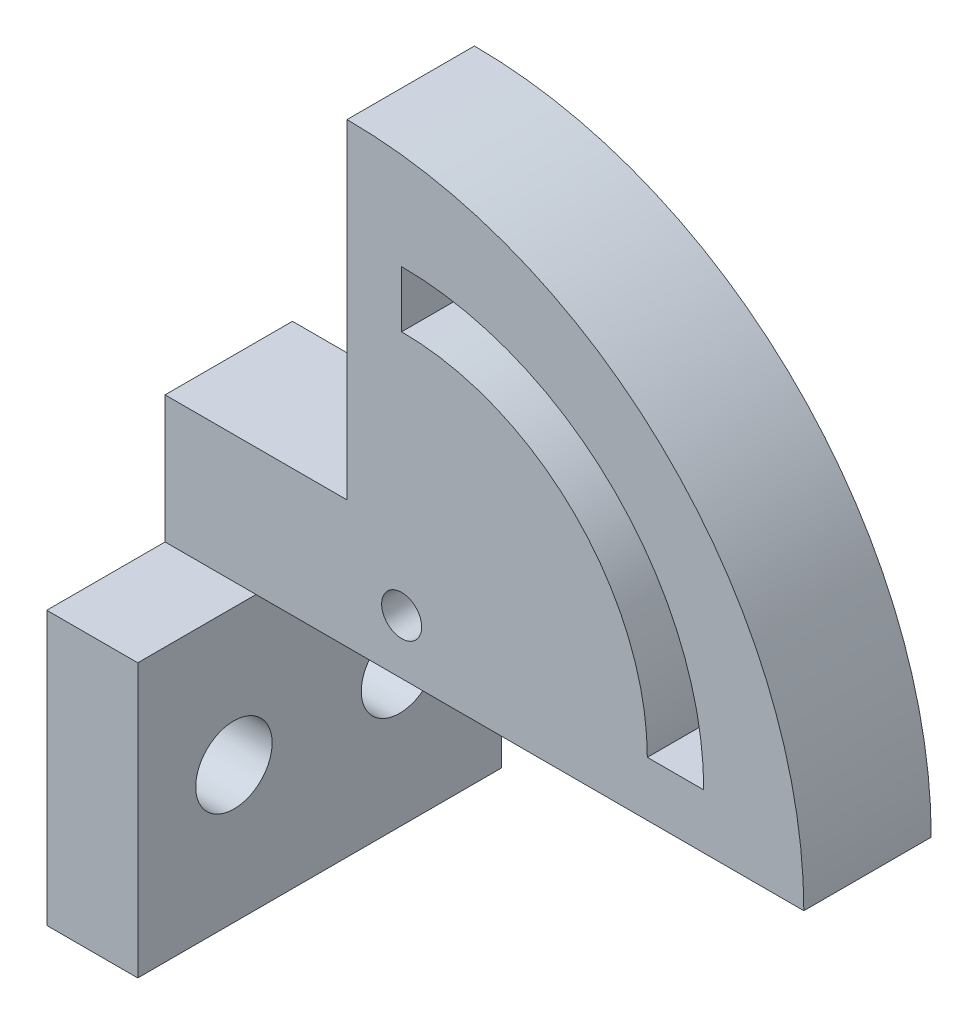
ISO-10303-21;
HEADER;
FILE_DESCRIPTION(('STEP AP214'),'2;1');
FILE_NAME('part.step','',(''),(''),'','','');
FILE_SCHEMA(('AUTOMOTIVE_DESIGN { 1 0 10303 214 1 1 1 1 }'));
ENDSEC;
DATA;
#1=APPLICATION_CONTEXT('core data for automotive mechanical design processes');
#2=APPLICATION_PROTOCOL_DEFINITION('international standard','automotive_design',2000,#1);
#3=PRODUCT_CONTEXT('',#1,'mechanical');
#4=PRODUCT('Part','Part','',(#3));
#5=PRODUCT_RELATED_PRODUCT_CATEGORY('part','',(#4));
#6=PRODUCT_DEFINITION_FORMATION('','',#4);
#7=PRODUCT_DEFINITION_CONTEXT('part definition',#1,'design');
#8=PRODUCT_DEFINITION('design','',#6,#7);
#9=PRODUCT_DEFINITION_SHAPE('','',#8);
#10=(LENGTH_UNIT() NAMED_UNIT(*) SI_UNIT(.MILLI.,.METRE.));
#11=(NAMED_UNIT(*) PLANE_ANGLE_UNIT() SI_UNIT($,.RADIAN.));
#12=(NAMED_UNIT(*) SI_UNIT($,.STERADIAN.) SOLID_ANGLE_UNIT());
#13=UNCERTAINTY_MEASURE_WITH_UNIT(LENGTH_MEASURE(1.E-05),#10,'distance_accuracy_value','');
#14=(GEOMETRIC_REPRESENTATION_CONTEXT(3) GLOBAL_UNCERTAINTY_ASSIGNED_CONTEXT((#13)) GLOBAL_UNIT_ASSIGNED_CONTEXT((#10,
#11,#12)) REPRESENTATION_CONTEXT('',''));
#15=CARTESIAN_POINT('',(0.,0.,0.));
#16=DIRECTION('',(0.,0.,1.));
#17=DIRECTION('',(1.,0.,0.));
#18=AXIS2_PLACEMENT_3D('',#15,#16,#17);
#19=CARTESIAN_POINT('',(0.,0.,-7.));
#20=DIRECTION('',(0.,0.,1.));
#21=DIRECTION('',(1.,0.,0.));
#22=AXIS2_PLACEMENT_3D('',#19,#20,#21);
#23=PLANE('',#22);
#24=DIRECTION('',(0.,-1.,0.));
#25=VECTOR('',#24,1.);
#26=CARTESIAN_POINT('',(3.,0.,-7.));
#27=LINE('',#26,#25);
#28=CARTESIAN_POINT('',(3.,19.6,-7.));
#29=VERTEX_POINT('',#28);
#30=CARTESIAN_POINT('',(3.,16.5,-7.));
#31=VERTEX_POINT('',#30);
#32=EDGE_CURVE('E171',#29,#31,#27,.T.);
#33=ORIENTED_EDGE('',*,*,#32,.T.);
#34=CARTESIAN_POINT('',(3.,3.,-7.));
#35=DIRECTION('',(0.,0.,1.));
#36=DIRECTION('',(1.,0.,0.));
#37=AXIS2_PLACEMENT_3D('',#34,#35,#36);
#38=CIRCLE('',#37,13.5);
#39=CARTESIAN_POINT('',(16.5,3.,-7.));
#40=VERTEX_POINT('',#39);
#41=EDGE_CURVE('E174',#31,#40,#38,.F.);
#42=ORIENTED_EDGE('',*,*,#41,.T.);
#43=DIRECTION('',(1.,0.,0.));
#44=VECTOR('',#43,1.);
#45=CARTESIAN_POINT('',(0.,3.,-7.));
#46=LINE('',#45,#44);
#47=CARTESIAN_POINT('',(19.6,3.,-7.));
#48=VERTEX_POINT('',#47);
#49=EDGE_CURVE('E168',#40,#48,#46,.T.);
#50=ORIENTED_EDGE('',*,*,#49,.T.);
#51=CARTESIAN_POINT('',(3.,3.,-7.));
#52=DIRECTION('',(0.,0.,1.));
#53=DIRECTION('',(1.,0.,0.));
#54=AXIS2_PLACEMENT_3D('',#51,#52,#53);
#55=CIRCLE('',#54,16.6);
#56=EDGE_CURVE('E140',#48,#29,#55,.T.);
#57=ORIENTED_EDGE('',*,*,#56,.T.);
#58=EDGE_LOOP('',(#33,#42,#50,#57));
#59=FACE_BOUND('',#58,.T.);
#60=CARTESIAN_POINT('',(3.,3.,-7.));
#61=DIRECTION('',(0.,0.,1.));
#62=DIRECTION('',(1.,0.,0.));
#63=AXIS2_PLACEMENT_3D('',#60,#61,#62);
#64=CIRCLE('',#63,1.1);
#65=CARTESIAN_POINT('',(4.1,3.,-7.));
#66=VERTEX_POINT('',#65);
#67=EDGE_CURVE('E165',#66,#66,#64,.T.);
#68=ORIENTED_EDGE('',*,*,#67,.T.);
#69=EDGE_LOOP('',(#68));
#70=FACE_BOUND('',#69,.T.);
#71=DIRECTION('',(1.,0.,0.));
#72=VECTOR('',#71,1.);
#73=CARTESIAN_POINT('',(-5.,0.,-7.));
#74=LINE('',#73,#72);
#75=CARTESIAN_POINT('',(-10.,0.,-7.));
#76=VERTEX_POINT('',#75);
#77=CARTESIAN_POINT('',(-5.,0.,-7.));
#78=VERTEX_POINT('',#77);
#79=EDGE_CURVE('E189',#76,#78,#74,.T.);
#80=ORIENTED_EDGE('',*,*,#79,.F.);
#81=DIRECTION('',(0.,-1.,0.));
#82=VECTOR('',#81,1.);
#83=CARTESIAN_POINT('',(-10.,0.,-7.));
#84=LINE('',#83,#82);
#85=CARTESIAN_POINT('',(-10.,6.99999999999996,-7.));
#86=VERTEX_POINT('',#85);
#87=EDGE_CURVE('E240',#86,#76,#84,.T.);
#88=ORIENTED_EDGE('',*,*,#87,.F.);
#89=DIRECTION('',(1.,0.,0.));
#90=VECTOR('',#89,1.);
#91=CARTESIAN_POINT('',(-10.,6.99999999999996,-7.));
#92=LINE('',#91,#90);
#93=CARTESIAN_POINT('',(0.,7.,-7.));
#94=VERTEX_POINT('',#93);
#95=EDGE_CURVE('E243',#86,#94,#92,.T.);
#96=ORIENTED_EDGE('',*,*,#95,.T.);
#97=DIRECTION('',(0.,-1.,0.));
#98=VECTOR('',#97,1.);
#99=CARTESIAN_POINT('',(0.,0.,-7.));
#100=LINE('',#99,#98);
#101=CARTESIAN_POINT('',(0.,25.1,-7.));
#102=VERTEX_POINT('',#101);
#103=EDGE_CURVE('E263',#102,#94,#100,.T.);
#104=ORIENTED_EDGE('',*,*,#103,.F.);
#105=CARTESIAN_POINT('',(0.,0.,-7.));
#106=DIRECTION('',(0.,0.,-1.));
#107=DIRECTION('',(-1.,0.,0.));
#108=AXIS2_PLACEMENT_3D('',#105,#106,#107);
#109=CIRCLE('',#108,25.1);
#110=CARTESIAN_POINT('',(25.1,0.,-7.));
#111=VERTEX_POINT('',#110);
#112=EDGE_CURVE('E11',#102,#111,#109,.T.);
#113=ORIENTED_EDGE('',*,*,#112,.T.);
#114=DIRECTION('',(-1.,0.,0.));
#115=VECTOR('',#114,1.);
#116=CARTESIAN_POINT('',(0.,0.,-7.));
#117=LINE('',#116,#115);
#118=EDGE_CURVE('E256',#111,#78,#117,.T.);
#119=ORIENTED_EDGE('',*,*,#118,.T.);
#120=EDGE_LOOP('',(#80,#88,#96,#104,#113,#119));
#121=FACE_BOUND('',#120,.T.);
#122=ADVANCED_FACE('F35',(#59,#70,#121),#23,.F.);
#123=CARTESIAN_POINT('',(0.,0.,0.));
#124=DIRECTION('',(0.,0.,-1.));
#125=DIRECTION('',(-1.,0.,0.));
#126=AXIS2_PLACEMENT_3D('',#123,#124,#125);
#127=PLANE('',#126);
#128=DIRECTION('',(1.,0.,0.));
#129=VECTOR('',#128,1.);
#130=CARTESIAN_POINT('',(16.5,3.,0.));
#131=LINE('',#130,#129);
#132=CARTESIAN_POINT('',(16.5,3.,0.));
#133=VERTEX_POINT('',#132);
#134=CARTESIAN_POINT('',(19.6,3.,0.));
#135=VERTEX_POINT('',#134);
#136=EDGE_CURVE('E146',#133,#135,#131,.T.);
#137=ORIENTED_EDGE('',*,*,#136,.F.);
#138=CARTESIAN_POINT('',(3.,3.,0.));
#139=DIRECTION('',(0.,0.,-1.));
#140=DIRECTION('',(1.,0.,0.));
#141=AXIS2_PLACEMENT_3D('',#138,#139,#140);
#142=CIRCLE('',#141,13.5);
#143=CARTESIAN_POINT('',(3.,16.5,0.));
#144=VERTEX_POINT('',#143);
#145=EDGE_CURVE('E57',#144,#133,#142,.T.);
#146=ORIENTED_EDGE('',*,*,#145,.F.);
#147=DIRECTION('',(0.,-1.,0.));
#148=VECTOR('',#147,1.);
#149=CARTESIAN_POINT('',(3.,16.5,0.));
#150=LINE('',#149,#148);
#151=CARTESIAN_POINT('',(3.,19.6,0.));
#152=VERTEX_POINT('',#151);
#153=EDGE_CURVE('E153',#152,#144,#150,.T.);
#154=ORIENTED_EDGE('',*,*,#153,.F.);
#155=CARTESIAN_POINT('',(3.,3.,0.));
#156=DIRECTION('',(0.,0.,1.));
#157=DIRECTION('',(1.,0.,0.));
#158=AXIS2_PLACEMENT_3D('',#155,#156,#157);
#159=CIRCLE('',#158,16.6);
#160=EDGE_CURVE('E137',#135,#152,#159,.T.);
#161=ORIENTED_EDGE('',*,*,#160,.F.);
#162=EDGE_LOOP('',(#137,#146,#154,#161));
#163=FACE_BOUND('',#162,.T.);
#164=CARTESIAN_POINT('',(3.,3.,0.));
#165=DIRECTION('',(0.,0.,1.));
#166=DIRECTION('',(1.,0.,0.));
#167=AXIS2_PLACEMENT_3D('',#164,#165,#166);
#168=CIRCLE('',#167,1.1);
#169=CARTESIAN_POINT('',(4.1,3.,0.));
#170=VERTEX_POINT('',#169);
#171=EDGE_CURVE('E160',#170,#170,#168,.T.);
#172=ORIENTED_EDGE('',*,*,#171,.F.);
#173=EDGE_LOOP('',(#172));
#174=FACE_BOUND('',#173,.T.);
#175=DIRECTION('',(-1.,0.,0.));
#176=VECTOR('',#175,1.);
#177=CARTESIAN_POINT('',(-5.,0.,0.));
#178=LINE('',#177,#176);
#179=CARTESIAN_POINT('',(-5.,0.,0.));
#180=VERTEX_POINT('',#179);
#181=CARTESIAN_POINT('',(-10.,0.,0.));
#182=VERTEX_POINT('',#181);
#183=EDGE_CURVE('E208',#180,#182,#178,.T.);
#184=ORIENTED_EDGE('',*,*,#183,.F.);
#185=DIRECTION('',(1.,0.,0.));
#186=VECTOR('',#185,1.);
#187=CARTESIAN_POINT('',(0.,0.,0.));
#188=LINE('',#187,#186);
#189=CARTESIAN_POINT('',(25.1,0.,0.));
#190=VERTEX_POINT('',#189);
#191=EDGE_CURVE('E251',#180,#190,#188,.T.);
#192=ORIENTED_EDGE('',*,*,#191,.T.);
#193=CARTESIAN_POINT('',(0.,0.,0.));
#194=DIRECTION('',(0.,0.,-1.));
#195=DIRECTION('',(-1.,0.,0.));
#196=AXIS2_PLACEMENT_3D('',#193,#194,#195);
#197=CIRCLE('',#196,25.1);
#198=CARTESIAN_POINT('',(0.,25.1,0.));
#199=VERTEX_POINT('',#198);
#200=EDGE_CURVE('E42',#199,#190,#197,.T.);
#201=ORIENTED_EDGE('',*,*,#200,.F.);
#202=DIRECTION('',(0.,1.,0.));
#203=VECTOR('',#202,1.);
#204=CARTESIAN_POINT('',(0.,0.,0.));
#205=LINE('',#204,#203);
#206=CARTESIAN_POINT('',(0.,7.,0.));
#207=VERTEX_POINT('',#206);
#208=EDGE_CURVE('E258',#207,#199,#205,.T.);
#209=ORIENTED_EDGE('',*,*,#208,.F.);
#210=DIRECTION('',(1.,0.,0.));
#211=VECTOR('',#210,1.);
#212=CARTESIAN_POINT('',(-10.,6.99999999999997,0.));
#213=LINE('',#212,#211);
#214=CARTESIAN_POINT('',(-10.,6.99999999999997,0.));
#215=VERTEX_POINT('',#214);
#216=EDGE_CURVE('E248',#215,#207,#213,.T.);
#217=ORIENTED_EDGE('',*,*,#216,.F.);
#218=DIRECTION('',(0.,1.,0.));
#219=VECTOR('',#218,1.);
#220=CARTESIAN_POINT('',(-10.,0.,0.));
#221=LINE('',#220,#219);
#222=EDGE_CURVE('E236',#182,#215,#221,.T.);
#223=ORIENTED_EDGE('',*,*,#222,.F.);
#224=EDGE_LOOP('',(#184,#192,#201,#209,#217,#223));
#225=FACE_BOUND('',#224,.T.);
#226=ADVANCED_FACE('F150',(#163,#174,#225),#127,.F.);
#227=CARTESIAN_POINT('',(0.,0.,0.));
#228=DIRECTION('',(1.,0.,0.));
#229=DIRECTION('',(0.,0.,-1.));
#230=AXIS2_PLACEMENT_3D('',#227,#228,#229);
#231=PLANE('',#230);
#232=DIRECTION('',(0.,0.,-1.));
#233=VECTOR('',#232,1.);
#234=CARTESIAN_POINT('',(0.,7.,0.));
#235=LINE('',#234,#233);
#236=EDGE_CURVE('E233',#207,#94,#235,.T.);
#237=ORIENTED_EDGE('',*,*,#236,.F.);
#238=ORIENTED_EDGE('',*,*,#208,.T.);
#239=DIRECTION('',(0.,0.,-1.));
#240=VECTOR('',#239,1.);
#241=CARTESIAN_POINT('',(0.,25.1,0.));
#242=LINE('',#241,#240);
#243=EDGE_CURVE('E260',#199,#102,#242,.T.);
#244=ORIENTED_EDGE('',*,*,#243,.T.);
#245=ORIENTED_EDGE('',*,*,#103,.T.);
#246=EDGE_LOOP('',(#237,#238,#244,#245));
#247=FACE_BOUND('',#246,.T.);
#248=ADVANCED_FACE('F281',(#247),#231,.F.);
#249=CARTESIAN_POINT('',(0.,0.,0.));
#250=DIRECTION('',(0.,0.,-1.));
#251=DIRECTION('',(-1.,0.,0.));
#252=AXIS2_PLACEMENT_3D('',#249,#250,#251);
#253=CYLINDRICAL_SURFACE('',#252,25.1);
#254=ORIENTED_EDGE('',*,*,#200,.T.);
#255=DIRECTION('',(0.,0.,-1.));
#256=VECTOR('',#255,1.);
#257=CARTESIAN_POINT('',(25.1,0.,0.));
#258=LINE('',#257,#256);
#259=EDGE_CURVE('E253',#190,#111,#258,.T.);
#260=ORIENTED_EDGE('',*,*,#259,.T.);
#261=ORIENTED_EDGE('',*,*,#112,.F.);
#262=ORIENTED_EDGE('',*,*,#243,.F.);
#263=EDGE_LOOP('',(#254,#260,#261,#262));
#264=FACE_BOUND('',#263,.T.);
#265=ADVANCED_FACE('F269',(#264),#253,.T.);
#266=CARTESIAN_POINT('',(0.,0.,0.));
#267=DIRECTION('',(0.,-1.,0.));
#268=DIRECTION('',(0.,0.,-1.));
#269=AXIS2_PLACEMENT_3D('',#266,#267,#268);
#270=PLANE('',#269);
#271=DIRECTION('',(0.,0.,1.));
#272=VECTOR('',#271,1.);
#273=CARTESIAN_POINT('',(-5.,0.,0.));
#274=LINE('',#273,#272);
#275=EDGE_CURVE('E228',#78,#180,#274,.T.);
#276=ORIENTED_EDGE('',*,*,#275,.F.);
#277=ORIENTED_EDGE('',*,*,#118,.F.);
#278=ORIENTED_EDGE('',*,*,#259,.F.);
#279=ORIENTED_EDGE('',*,*,#191,.F.);
#280=EDGE_LOOP('',(#276,#277,#278,#279));
#281=FACE_BOUND('',#280,.T.);
#282=ADVANCED_FACE('F276',(#281),#270,.T.);
#283=CARTESIAN_POINT('',(-10.,6.99999999999997,0.));
#284=DIRECTION('',(0.,-1.,0.));
#285=DIRECTION('',(1.,0.,0.));
#286=AXIS2_PLACEMENT_3D('',#283,#284,#285);
#287=PLANE('',#286);
#288=ORIENTED_EDGE('',*,*,#236,.T.);
#289=ORIENTED_EDGE('',*,*,#95,.F.);
#290=DIRECTION('',(0.,0.,-1.));
#291=VECTOR('',#290,1.);
#292=CARTESIAN_POINT('',(-10.,6.99999999999997,0.));
#293=LINE('',#292,#291);
#294=EDGE_CURVE('E238',#215,#86,#293,.T.);
#295=ORIENTED_EDGE('',*,*,#294,.F.);
#296=ORIENTED_EDGE('',*,*,#216,.T.);
#297=EDGE_LOOP('',(#288,#289,#295,#296));
#298=FACE_BOUND('',#297,.T.);
#299=ADVANCED_FACE('F285',(#298),#287,.F.);
#300=CARTESIAN_POINT('',(-10.,0.,0.));
#301=DIRECTION('',(-1.,0.,0.));
#302=DIRECTION('',(0.,-1.,0.));
#303=AXIS2_PLACEMENT_3D('',#300,#301,#302);
#304=PLANE('',#303);
#305=CARTESIAN_POINT('',(-9.99999999999997,-7.5,1.216));
#306=DIRECTION('',(-1.,0.,0.));
#307=DIRECTION('',(0.,-1.,0.));
#308=AXIS2_PLACEMENT_3D('',#305,#306,#307);
#309=CIRCLE('',#308,2.1);
#310=CARTESIAN_POINT('',(-9.99999999999997,-9.6,1.216));
#311=VERTEX_POINT('',#310);
#312=EDGE_CURVE('E186',#311,#311,#309,.T.);
#313=ORIENTED_EDGE('',*,*,#312,.F.);
#314=EDGE_LOOP('',(#313));
#315=FACE_BOUND('',#314,.T.);
#316=CARTESIAN_POINT('',(-9.99999999999997,-7.5,-7.882));
#317=DIRECTION('',(-1.,0.,0.));
#318=DIRECTION('',(0.,-1.,0.));
#319=AXIS2_PLACEMENT_3D('',#316,#317,#318);
#320=CIRCLE('',#319,2.1);
#321=CARTESIAN_POINT('',(-9.99999999999997,-9.6,-7.882));
#322=VERTEX_POINT('',#321);
#323=EDGE_CURVE('E181',#322,#322,#320,.T.);
#324=ORIENTED_EDGE('',*,*,#323,.F.);
#325=EDGE_LOOP('',(#324));
#326=FACE_BOUND('',#325,.T.);
#327=DIRECTION('',(0.,0.,-1.));
#328=VECTOR('',#327,1.);
#329=CARTESIAN_POINT('',(-10.,-15.,0.));
#330=LINE('',#329,#328);
#331=CARTESIAN_POINT('',(-10.,-15.,6.5));
#332=VERTEX_POINT('',#331);
#333=CARTESIAN_POINT('',(-10.,-15.,-13.5));
#334=VERTEX_POINT('',#333);
#335=EDGE_CURVE('E229',#332,#334,#330,.T.);
#336=ORIENTED_EDGE('',*,*,#335,.F.);
#337=DIRECTION('',(0.,-1.,0.));
#338=VECTOR('',#337,1.);
#339=CARTESIAN_POINT('',(-10.,0.,6.5));
#340=LINE('',#339,#338);
#341=CARTESIAN_POINT('',(-10.,0.,6.5));
#342=VERTEX_POINT('',#341);
#343=EDGE_CURVE('E214',#342,#332,#340,.T.);
#344=ORIENTED_EDGE('',*,*,#343,.F.);
#345=DIRECTION('',(0.,0.,-1.));
#346=VECTOR('',#345,1.);
#347=CARTESIAN_POINT('',(-10.,0.,6.5));
#348=LINE('',#347,#346);
#349=EDGE_CURVE('E220',#342,#182,#348,.T.);
#350=ORIENTED_EDGE('',*,*,#349,.T.);
#351=ORIENTED_EDGE('',*,*,#222,.T.);
#352=ORIENTED_EDGE('',*,*,#294,.T.);
#353=ORIENTED_EDGE('',*,*,#87,.T.);
#354=DIRECTION('',(0.,0.,1.));
#355=VECTOR('',#354,1.);
#356=CARTESIAN_POINT('',(-10.,0.,-13.5));
#357=LINE('',#356,#355);
#358=CARTESIAN_POINT('',(-10.,0.,-13.5));
#359=VERTEX_POINT('',#358);
#360=EDGE_CURVE('E205',#359,#76,#357,.T.);
#361=ORIENTED_EDGE('',*,*,#360,.F.);
#362=DIRECTION('',(0.,1.,0.));
#363=VECTOR('',#362,1.);
#364=CARTESIAN_POINT('',(-10.,0.,-13.5));
#365=LINE('',#364,#363);
#366=EDGE_CURVE('E196',#334,#359,#365,.T.);
#367=ORIENTED_EDGE('',*,*,#366,.F.);
#368=EDGE_LOOP('',(#336,#344,#350,#351,#352,#353,#361,#367));
#369=FACE_BOUND('',#368,.T.);
#370=ADVANCED_FACE('F288',(#315,#326,#369),#304,.T.);
#371=CARTESIAN_POINT('',(-5.,-15.,0.));
#372=DIRECTION('',(-1.,0.,0.));
#373=DIRECTION('',(0.,0.,1.));
#374=AXIS2_PLACEMENT_3D('',#371,#372,#373);
#375=PLANE('',#374);
#376=CARTESIAN_POINT('',(-5.,-7.5,1.216));
#377=DIRECTION('',(1.,0.,0.));
#378=DIRECTION('',(0.,0.,-1.));
#379=AXIS2_PLACEMENT_3D('',#376,#377,#378);
#380=CIRCLE('',#379,2.1);
#381=CARTESIAN_POINT('',(-5.,-7.5,-0.884));
#382=VERTEX_POINT('',#381);
#383=EDGE_CURVE('E178',#382,#382,#380,.T.);
#384=ORIENTED_EDGE('',*,*,#383,.F.);
#385=EDGE_LOOP('',(#384));
#386=FACE_BOUND('',#385,.T.);
#387=CARTESIAN_POINT('',(-5.,-7.5,-7.882));
#388=DIRECTION('',(1.,0.,0.));
#389=DIRECTION('',(0.,0.,-1.));
#390=AXIS2_PLACEMENT_3D('',#387,#388,#389);
#391=CIRCLE('',#390,2.1);
#392=CARTESIAN_POINT('',(-5.,-7.5,-9.982));
#393=VERTEX_POINT('',#392);
#394=EDGE_CURVE('E177',#393,#393,#391,.T.);
#395=ORIENTED_EDGE('',*,*,#394,.F.);
#396=EDGE_LOOP('',(#395));
#397=FACE_BOUND('',#396,.T.);
#398=ORIENTED_EDGE('',*,*,#275,.T.);
#399=DIRECTION('',(0.,0.,-1.));
#400=VECTOR('',#399,1.);
#401=CARTESIAN_POINT('',(-5.,0.,6.5));
#402=LINE('',#401,#400);
#403=CARTESIAN_POINT('',(-5.,0.,6.5));
#404=VERTEX_POINT('',#403);
#405=EDGE_CURVE('E225',#404,#180,#402,.T.);
#406=ORIENTED_EDGE('',*,*,#405,.F.);
#407=DIRECTION('',(0.,1.,0.));
#408=VECTOR('',#407,1.);
#409=CARTESIAN_POINT('',(-5.,0.,6.5));
#410=LINE('',#409,#408);
#411=CARTESIAN_POINT('',(-5.,-15.,6.5));
#412=VERTEX_POINT('',#411);
#413=EDGE_CURVE('E209',#412,#404,#410,.T.);
#414=ORIENTED_EDGE('',*,*,#413,.F.);
#415=DIRECTION('',(0.,0.,1.));
#416=VECTOR('',#415,1.);
#417=CARTESIAN_POINT('',(-5.,-15.,0.));
#418=LINE('',#417,#416);
#419=CARTESIAN_POINT('',(-5.,-15.,-13.5));
#420=VERTEX_POINT('',#419);
#421=EDGE_CURVE('E231',#420,#412,#418,.T.);
#422=ORIENTED_EDGE('',*,*,#421,.F.);
#423=DIRECTION('',(0.,-1.,0.));
#424=VECTOR('',#423,1.);
#425=CARTESIAN_POINT('',(-5.,0.,-13.5));
#426=LINE('',#425,#424);
#427=CARTESIAN_POINT('',(-5.,0.,-13.5));
#428=VERTEX_POINT('',#427);
#429=EDGE_CURVE('E190',#428,#420,#426,.T.);
#430=ORIENTED_EDGE('',*,*,#429,.F.);
#431=DIRECTION('',(0.,0.,1.));
#432=VECTOR('',#431,1.);
#433=CARTESIAN_POINT('',(-5.,0.,-13.5));
#434=LINE('',#433,#432);
#435=EDGE_CURVE('E200',#428,#78,#434,.T.);
#436=ORIENTED_EDGE('',*,*,#435,.T.);
#437=EDGE_LOOP('',(#398,#406,#414,#422,#430,#436));
#438=FACE_BOUND('',#437,.T.);
#439=ADVANCED_FACE('F297',(#386,#397,#438),#375,.F.);
#440=CARTESIAN_POINT('',(0.,-15.,0.));
#441=DIRECTION('',(0.,-1.,0.));
#442=DIRECTION('',(0.,0.,-1.));
#443=AXIS2_PLACEMENT_3D('',#440,#441,#442);
#444=PLANE('',#443);
#445=ORIENTED_EDGE('',*,*,#335,.T.);
#446=DIRECTION('',(-1.,0.,0.));
#447=VECTOR('',#446,1.);
#448=CARTESIAN_POINT('',(-5.,-15.,-13.5));
#449=LINE('',#448,#447);
#450=EDGE_CURVE('E193',#420,#334,#449,.T.);
#451=ORIENTED_EDGE('',*,*,#450,.F.);
#452=ORIENTED_EDGE('',*,*,#421,.T.);
#453=DIRECTION('',(1.,0.,0.));
#454=VECTOR('',#453,1.);
#455=CARTESIAN_POINT('',(-5.,-15.,6.5));
#456=LINE('',#455,#454);
#457=EDGE_CURVE('E217',#332,#412,#456,.T.);
#458=ORIENTED_EDGE('',*,*,#457,.F.);
#459=EDGE_LOOP('',(#445,#451,#452,#458));
#460=FACE_BOUND('',#459,.T.);
#461=ADVANCED_FACE('F308',(#460),#444,.T.);
#462=CARTESIAN_POINT('',(-5.,0.,6.5));
#463=DIRECTION('',(0.,-1.,0.));
#464=DIRECTION('',(0.,0.,-1.));
#465=AXIS2_PLACEMENT_3D('',#462,#463,#464);
#466=PLANE('',#465);
#467=ORIENTED_EDGE('',*,*,#183,.T.);
#468=ORIENTED_EDGE('',*,*,#349,.F.);
#469=DIRECTION('',(-1.,0.,0.));
#470=VECTOR('',#469,1.);
#471=CARTESIAN_POINT('',(-5.,0.,6.5));
#472=LINE('',#471,#470);
#473=EDGE_CURVE('E212',#404,#342,#472,.T.);
#474=ORIENTED_EDGE('',*,*,#473,.F.);
#475=ORIENTED_EDGE('',*,*,#405,.T.);
#476=EDGE_LOOP('',(#467,#468,#474,#475));
#477=FACE_BOUND('',#476,.T.);
#478=ADVANCED_FACE('F293',(#477),#466,.F.);
#479=CARTESIAN_POINT('',(0.,0.,6.5));
#480=DIRECTION('',(0.,0.,-1.));
#481=DIRECTION('',(-1.,0.,0.));
#482=AXIS2_PLACEMENT_3D('',#479,#480,#481);
#483=PLANE('',#482);
#484=ORIENTED_EDGE('',*,*,#413,.T.);
#485=ORIENTED_EDGE('',*,*,#473,.T.);
#486=ORIENTED_EDGE('',*,*,#343,.T.);
#487=ORIENTED_EDGE('',*,*,#457,.T.);
#488=EDGE_LOOP('',(#484,#485,#486,#487));
#489=FACE_BOUND('',#488,.T.);
#490=ADVANCED_FACE('F311',(#489),#483,.F.);
#491=CARTESIAN_POINT('',(-5.,0.,-13.5));
#492=DIRECTION('',(0.,-1.,0.));
#493=DIRECTION('',(0.,0.,-1.));
#494=AXIS2_PLACEMENT_3D('',#491,#492,#493);
#495=PLANE('',#494);
#496=ORIENTED_EDGE('',*,*,#79,.T.);
#497=ORIENTED_EDGE('',*,*,#435,.F.);
#498=DIRECTION('',(1.,0.,0.));
#499=VECTOR('',#498,1.);
#500=CARTESIAN_POINT('',(-5.,0.,-13.5));
#501=LINE('',#500,#499);
#502=EDGE_CURVE('E198',#359,#428,#501,.T.);
#503=ORIENTED_EDGE('',*,*,#502,.F.);
#504=ORIENTED_EDGE('',*,*,#360,.T.);
#505=EDGE_LOOP('',(#496,#497,#503,#504));
#506=FACE_BOUND('',#505,.T.);
#507=ADVANCED_FACE('F302',(#506),#495,.F.);
#508=CARTESIAN_POINT('',(0.,0.,-13.5));
#509=DIRECTION('',(0.,0.,-1.));
#510=DIRECTION('',(-1.,0.,0.));
#511=AXIS2_PLACEMENT_3D('',#508,#509,#510);
#512=PLANE('',#511);
#513=ORIENTED_EDGE('',*,*,#429,.T.);
#514=ORIENTED_EDGE('',*,*,#450,.T.);
#515=ORIENTED_EDGE('',*,*,#366,.T.);
#516=ORIENTED_EDGE('',*,*,#502,.T.);
#517=EDGE_LOOP('',(#513,#514,#515,#516));
#518=FACE_BOUND('',#517,.T.);
#519=ADVANCED_FACE('F305',(#518),#512,.T.);
#520=CARTESIAN_POINT('',(-23.5,-7.5,-7.882));
#521=DIRECTION('',(1.,0.,0.));
#522=DIRECTION('',(0.,0.,-1.));
#523=AXIS2_PLACEMENT_3D('',#520,#521,#522);
#524=CYLINDRICAL_SURFACE('',#523,2.1);
#525=ORIENTED_EDGE('',*,*,#323,.T.);
#526=EDGE_LOOP('',(#525));
#527=FACE_BOUND('',#526,.T.);
#528=ORIENTED_EDGE('',*,*,#394,.T.);
#529=EDGE_LOOP('',(#528));
#530=FACE_BOUND('',#529,.T.);
#531=ADVANCED_FACE('F341',(#527,#530),#524,.F.);
#532=CARTESIAN_POINT('',(-23.5,-7.5,1.216));
#533=DIRECTION('',(1.,0.,0.));
#534=DIRECTION('',(0.,0.,-1.));
#535=AXIS2_PLACEMENT_3D('',#532,#533,#534);
#536=CYLINDRICAL_SURFACE('',#535,2.1);
#537=ORIENTED_EDGE('',*,*,#312,.T.);
#538=EDGE_LOOP('',(#537));
#539=FACE_BOUND('',#538,.T.);
#540=ORIENTED_EDGE('',*,*,#383,.T.);
#541=EDGE_LOOP('',(#540));
#542=FACE_BOUND('',#541,.T.);
#543=ADVANCED_FACE('F332',(#539,#542),#536,.F.);
#544=CARTESIAN_POINT('',(3.,3.,-10.));
#545=DIRECTION('',(0.,0.,1.));
#546=DIRECTION('',(1.,0.,0.));
#547=AXIS2_PLACEMENT_3D('',#544,#545,#546);
#548=CYLINDRICAL_SURFACE('',#547,1.1);
#549=ORIENTED_EDGE('',*,*,#171,.T.);
#550=EDGE_LOOP('',(#549));
#551=FACE_BOUND('',#550,.T.);
#552=ORIENTED_EDGE('',*,*,#67,.F.);
#553=EDGE_LOOP('',(#552));
#554=FACE_BOUND('',#553,.T.);
#555=ADVANCED_FACE('F329',(#551,#554),#548,.F.);
#556=CARTESIAN_POINT('',(3.,3.,-10.));
#557=DIRECTION('',(0.,0.,1.));
#558=DIRECTION('',(1.,0.,0.));
#559=AXIS2_PLACEMENT_3D('',#556,#557,#558);
#560=CYLINDRICAL_SURFACE('',#559,13.5);
#561=DIRECTION('',(0.,0.,1.));
#562=VECTOR('',#561,1.);
#563=CARTESIAN_POINT('',(3.,16.5,-10.));
#564=LINE('',#563,#562);
#565=EDGE_CURVE('E158',#31,#144,#564,.T.);
#566=ORIENTED_EDGE('',*,*,#565,.T.);
#567=ORIENTED_EDGE('',*,*,#145,.T.);
#568=DIRECTION('',(0.,0.,1.));
#569=VECTOR('',#568,1.);
#570=CARTESIAN_POINT('',(16.5,3.,-10.));
#571=LINE('',#570,#569);
#572=EDGE_CURVE('E143',#40,#133,#571,.T.);
#573=ORIENTED_EDGE('',*,*,#572,.F.);
#574=ORIENTED_EDGE('',*,*,#41,.F.);
#575=EDGE_LOOP('',(#566,#567,#573,#574));
#576=FACE_BOUND('',#575,.T.);
#577=ADVANCED_FACE('F331',(#576),#560,.T.);
#578=CARTESIAN_POINT('',(3.,16.5,-10.));
#579=DIRECTION('',(-1.,0.,0.));
#580=DIRECTION('',(0.,0.,1.));
#581=AXIS2_PLACEMENT_3D('',#578,#579,#580);
#582=PLANE('',#581);
#583=DIRECTION('',(0.,0.,1.));
#584=VECTOR('',#583,1.);
#585=CARTESIAN_POINT('',(3.,19.6,-10.));
#586=LINE('',#585,#584);
#587=EDGE_CURVE('E142',#29,#152,#586,.T.);
#588=ORIENTED_EDGE('',*,*,#587,.T.);
#589=ORIENTED_EDGE('',*,*,#153,.T.);
#590=ORIENTED_EDGE('',*,*,#565,.F.);
#591=ORIENTED_EDGE('',*,*,#32,.F.);
#592=EDGE_LOOP('',(#588,#589,#590,#591));
#593=FACE_BOUND('',#592,.T.);
#594=ADVANCED_FACE('F339',(#593),#582,.F.);
#595=CARTESIAN_POINT('',(3.,3.,-10.));
#596=DIRECTION('',(0.,0.,1.));
#597=DIRECTION('',(1.,0.,0.));
#598=AXIS2_PLACEMENT_3D('',#595,#596,#597);
#599=CYLINDRICAL_SURFACE('',#598,16.6);
#600=DIRECTION('',(0.,0.,1.));
#601=VECTOR('',#600,1.);
#602=CARTESIAN_POINT('',(19.6,3.,-10.));
#603=LINE('',#602,#601);
#604=EDGE_CURVE('E49',#48,#135,#603,.T.);
#605=ORIENTED_EDGE('',*,*,#604,.T.);
#606=ORIENTED_EDGE('',*,*,#160,.T.);
#607=ORIENTED_EDGE('',*,*,#587,.F.);
#608=ORIENTED_EDGE('',*,*,#56,.F.);
#609=EDGE_LOOP('',(#605,#606,#607,#608));
#610=FACE_BOUND('',#609,.T.);
#611=ADVANCED_FACE('F134',(#610),#599,.F.);
#612=CARTESIAN_POINT('',(16.5,3.,-10.));
#613=DIRECTION('',(0.,-1.,0.));
#614=DIRECTION('',(0.,0.,-1.));
#615=AXIS2_PLACEMENT_3D('',#612,#613,#614);
#616=PLANE('',#615);
#617=ORIENTED_EDGE('',*,*,#572,.T.);
#618=ORIENTED_EDGE('',*,*,#136,.T.);
#619=ORIENTED_EDGE('',*,*,#604,.F.);
#620=ORIENTED_EDGE('',*,*,#49,.F.);
#621=EDGE_LOOP('',(#617,#618,#619,#620));
#622=FACE_BOUND('',#621,.T.);
#623=ADVANCED_FACE('F147',(#622),#616,.F.);
#624=CLOSED_SHELL('',(#122,#226,#248,#265,#282,#299,#370,#439,#461,#478,#490,#507,#519,#531,
#543,#555,#577,#594,#611,#623));
#625=MANIFOLD_SOLID_BREP('B2',#624);
#626=ADVANCED_BREP_SHAPE_REPRESENTATION('',(#18,#625),#14);
#627=SHAPE_DEFINITION_REPRESENTATION(#9,#626);
ENDSEC;
END-ISO-10303-21;
